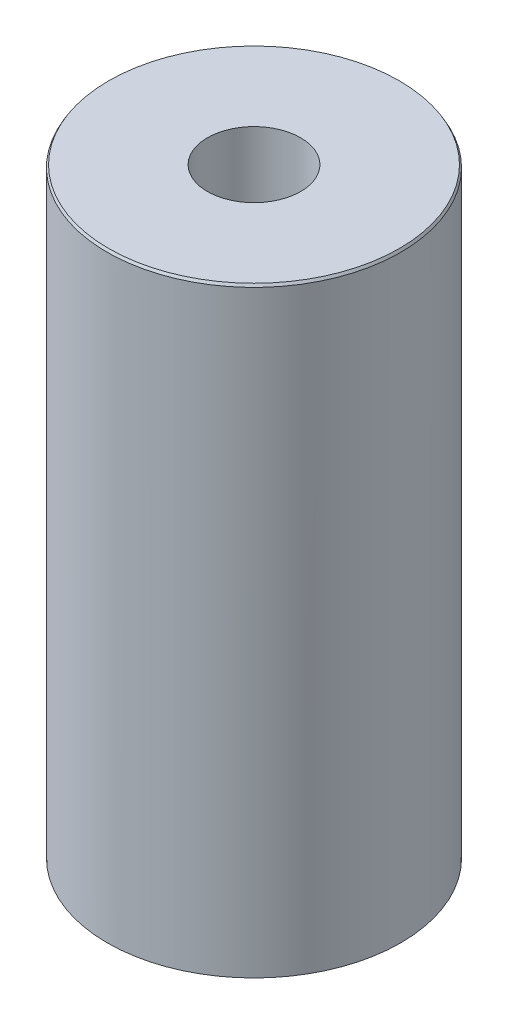
ISO-10303-21;
HEADER;
FILE_DESCRIPTION(('STEP AP214'),'2;1');
FILE_NAME('part.step','',(''),(''),'','','');
FILE_SCHEMA(('AUTOMOTIVE_DESIGN { 1 0 10303 214 1 1 1 1 }'));
ENDSEC;
DATA;
#1=APPLICATION_CONTEXT('core data for automotive mechanical design processes');
#2=APPLICATION_PROTOCOL_DEFINITION('international standard','automotive_design',2000,#1);
#3=PRODUCT_CONTEXT('',#1,'mechanical');
#4=PRODUCT('Part','Part','',(#3));
#5=PRODUCT_RELATED_PRODUCT_CATEGORY('part','',(#4));
#6=PRODUCT_DEFINITION_FORMATION('','',#4);
#7=PRODUCT_DEFINITION_CONTEXT('part definition',#1,'design');
#8=PRODUCT_DEFINITION('design','',#6,#7);
#9=PRODUCT_DEFINITION_SHAPE('','',#8);
#10=(LENGTH_UNIT() NAMED_UNIT(*) SI_UNIT(.MILLI.,.METRE.));
#11=(NAMED_UNIT(*) PLANE_ANGLE_UNIT() SI_UNIT($,.RADIAN.));
#12=(NAMED_UNIT(*) SI_UNIT($,.STERADIAN.) SOLID_ANGLE_UNIT());
#13=UNCERTAINTY_MEASURE_WITH_UNIT(LENGTH_MEASURE(1.E-05),#10,'distance_accuracy_value','');
#14=(GEOMETRIC_REPRESENTATION_CONTEXT(3) GLOBAL_UNCERTAINTY_ASSIGNED_CONTEXT((#13)) GLOBAL_UNIT_ASSIGNED_CONTEXT((#10,
#11,#12)) REPRESENTATION_CONTEXT('',''));
#15=CARTESIAN_POINT('',(0.,0.,0.));
#16=DIRECTION('',(0.,0.,1.));
#17=DIRECTION('',(1.,0.,0.));
#18=AXIS2_PLACEMENT_3D('',#15,#16,#17);
#19=CARTESIAN_POINT('',(0.,235.873118485517,0.));
#20=DIRECTION('',(0.,-1.,0.));
#21=DIRECTION('',(0.,0.,-1.));
#22=AXIS2_PLACEMENT_3D('',#19,#20,#21);
#23=CYLINDRICAL_SURFACE('',#22,57.5);
#24=CARTESIAN_POINT('',(0.,234.875667608635,0.));
#25=DIRECTION('',(0.,1.,0.));
#26=DIRECTION('',(0.,0.,1.));
#27=AXIS2_PLACEMENT_3D('',#24,#25,#26);
#28=CIRCLE('',#27,57.5);
#29=CARTESIAN_POINT('',(0.,234.875667608635,-57.5));
#30=VERTEX_POINT('',#29);
#31=EDGE_CURVE('E50',#30,#30,#28,.F.);
#32=CARTESIAN_POINT('',(0.,0.575878532271534,0.));
#33=DIRECTION('',(0.,1.,0.));
#34=DIRECTION('',(0.,0.,1.));
#35=AXIS2_PLACEMENT_3D('',#32,#33,#34);
#36=CIRCLE('',#35,57.5);
#37=CARTESIAN_POINT('',(0.,0.575878532271534,-57.5));
#38=VERTEX_POINT('',#37);
#39=EDGE_CURVE('E51',#38,#38,#36,.T.);
#40=CARTESIAN_POINT('',(0.,234.875667608635,-57.5));
#41=CARTESIAN_POINT('',(0.,232.435044805756,-57.5));
#42=CARTESIAN_POINT('',(0.,229.994422002877,-57.5));
#43=CARTESIAN_POINT('',(0.,225.113176397119,-57.5));
#44=CARTESIAN_POINT('',(0.,222.672553594241,-57.5));
#45=CARTESIAN_POINT('',(0.,217.791307988483,-57.5));
#46=CARTESIAN_POINT('',(0.,215.350685185604,-57.5));
#47=CARTESIAN_POINT('',(0.,210.469439579847,-57.5));
#48=CARTESIAN_POINT('',(0.,208.028816776968,-57.5));
#49=CARTESIAN_POINT('',(0.,203.14757117121,-57.5));
#50=CARTESIAN_POINT('',(0.,200.706948368332,-57.5));
#51=CARTESIAN_POINT('',(0.,195.825702762574,-57.5));
#52=CARTESIAN_POINT('',(0.,193.385079959695,-57.5));
#53=CARTESIAN_POINT('',(0.,188.503834353938,-57.5));
#54=CARTESIAN_POINT('',(0.,186.063211551059,-57.5));
#55=CARTESIAN_POINT('',(0.,181.181965945301,-57.5));
#56=CARTESIAN_POINT('',(0.,178.741343142423,-57.5));
#57=CARTESIAN_POINT('',(0.,173.860097536665,-57.5));
#58=CARTESIAN_POINT('',(0.,171.419474733786,-57.5));
#59=CARTESIAN_POINT('',(0.,166.538229128029,-57.5));
#60=CARTESIAN_POINT('',(0.,164.09760632515,-57.5));
#61=CARTESIAN_POINT('',(0.,159.216360719392,-57.5));
#62=CARTESIAN_POINT('',(0.,156.775737916514,-57.5));
#63=CARTESIAN_POINT('',(0.,151.894492310756,-57.5));
#64=CARTESIAN_POINT('',(0.,149.453869507877,-57.5));
#65=CARTESIAN_POINT('',(0.,144.57262390212,-57.5));
#66=CARTESIAN_POINT('',(0.,142.132001099241,-57.5));
#67=CARTESIAN_POINT('',(0.,137.250755493483,-57.5));
#68=CARTESIAN_POINT('',(0.,134.810132690605,-57.5));
#69=CARTESIAN_POINT('',(0.,129.928887084847,-57.5));
#70=CARTESIAN_POINT('',(0.,127.488264281968,-57.5));
#71=CARTESIAN_POINT('',(0.,122.607018676211,-57.5));
#72=CARTESIAN_POINT('',(0.,120.166395873332,-57.5));
#73=CARTESIAN_POINT('',(0.,115.285150267574,-57.5));
#74=CARTESIAN_POINT('',(0.,112.844527464695,-57.5));
#75=CARTESIAN_POINT('',(0.,107.963281858938,-57.5));
#76=CARTESIAN_POINT('',(0.,105.522659056059,-57.5));
#77=CARTESIAN_POINT('',(0.,100.641413450302,-57.5));
#78=CARTESIAN_POINT('',(0.,98.2007906474228,-57.5));
#79=CARTESIAN_POINT('',(0.,93.3195450416652,-57.5));
#80=CARTESIAN_POINT('',(0.,90.8789222387864,-57.5));
#81=CARTESIAN_POINT('',(0.,85.9976766330289,-57.5));
#82=CARTESIAN_POINT('',(0.,83.5570538301501,-57.5));
#83=CARTESIAN_POINT('',(0.,78.6758082243925,-57.5));
#84=CARTESIAN_POINT('',(0.,76.2351854215138,-57.5));
#85=CARTESIAN_POINT('',(0.,71.3539398157562,-57.5));
#86=CARTESIAN_POINT('',(0.,68.9133170128774,-57.5));
#87=CARTESIAN_POINT('',(0.,64.0320714071198,-57.5));
#88=CARTESIAN_POINT('',(0.,61.5914486042411,-57.5));
#89=CARTESIAN_POINT('',(0.,56.7102029984835,-57.5));
#90=CARTESIAN_POINT('',(0.,54.2695801956047,-57.5));
#91=CARTESIAN_POINT('',(0.,49.3883345898472,-57.5));
#92=CARTESIAN_POINT('',(0.,46.9477117869684,-57.5));
#93=CARTESIAN_POINT('',(0.,42.0664661812108,-57.5));
#94=CARTESIAN_POINT('',(0.,39.625843378332,-57.5));
#95=CARTESIAN_POINT('',(0.,34.7445977725745,-57.5));
#96=CARTESIAN_POINT('',(0.,32.3039749696957,-57.5));
#97=CARTESIAN_POINT('',(0.,27.4227293639381,-57.5));
#98=CARTESIAN_POINT('',(0.,24.9821065610594,-57.5));
#99=CARTESIAN_POINT('',(0.,20.1008609553018,-57.5));
#100=CARTESIAN_POINT('',(0.,17.660238152423,-57.5));
#101=CARTESIAN_POINT('',(0.,12.7789925466654,-57.5));
#102=CARTESIAN_POINT('',(0.,10.3383697437867,-57.5));
#103=CARTESIAN_POINT('',(0.,5.4571241380291,-57.5));
#104=CARTESIAN_POINT('',(0.,3.01650133515032,-57.5));
#105=CARTESIAN_POINT('',(0.,0.575878532271534,-57.5));
#106=B_SPLINE_CURVE_WITH_KNOTS('',3,(#40,#41,#42,#43,#44,#45,#46,#47,#48,#49,#50,#51,#52,#53,
#54,#55,#56,#57,#58,#59,#60,#61,#62,#63,#64,#65,#66,#67,#68,#69,#70,#71,#72,#73,#74,#75,#76,#77,
#78,#79,#80,#81,#82,#83,#84,#85,#86,#87,#88,#89,#90,#91,#92,#93,#94,#95,#96,#97,#98,#99,#100,
#101,#102,#103,#104,#105),.UNSPECIFIED.,.F.,.F.,(4,2,2,2,2,2,2,2,2,2,2,2,2,2,2,2,2,2,2,2,2,2,2,
2,2,2,2,2,2,2,2,2,4),(0.,7.32186840863633,14.6437368172727,21.965605225909,29.2874736345454,
36.6093420431817,43.9312104518181,51.2530788604544,58.5749472690907,65.8968156777271,
73.2186840863634,80.5405524949997,87.8624209036361,95.1842893122724,102.506157720909,
109.828026129545,117.149894538181,124.471762946818,131.793631355454,139.115499764091,
146.437368172727,153.759236581363,161.08110499,168.402973398636,175.724841807272,
183.046710215909,190.368578624545,197.690447033181,205.012315441818,212.334183850454,
219.65605225909,226.977920667727,234.299789076363),.UNSPECIFIED.);
#107=EDGE_CURVE('BSEAM39',#30,#38,#106,.T.);
#108=ORIENTED_EDGE('',*,*,#31,.T.);
#109=ORIENTED_EDGE('',*,*,#39,.T.);
#110=ORIENTED_EDGE('',*,*,#107,.T.);
#111=ORIENTED_EDGE('',*,*,#107,.F.);
#112=EDGE_LOOP('',(#108,#110,#109,#111));
#113=FACE_BOUND('',#112,.T.);
#114=ADVANCED_FACE('F39',(#113),#23,.T.);
#115=CARTESIAN_POINT('',(0.,235.873118485517,0.));
#116=DIRECTION('',(0.,1.,0.));
#117=DIRECTION('',(0.,0.,1.));
#118=AXIS2_PLACEMENT_3D('',#115,#116,#117);
#119=PLANE('',#118);
#120=CARTESIAN_POINT('',(0.,235.873118485517,0.));
#121=DIRECTION('',(0.,1.,0.));
#122=DIRECTION('',(0.,0.,1.));
#123=AXIS2_PLACEMENT_3D('',#120,#121,#122);
#124=CIRCLE('',#123,56.9241214677287);
#125=CARTESIAN_POINT('',(0.,235.873118485517,56.9241214677287));
#126=VERTEX_POINT('',#125);
#127=EDGE_CURVE('E54',#126,#126,#124,.T.);
#128=ORIENTED_EDGE('',*,*,#127,.T.);
#129=EDGE_LOOP('',(#128));
#130=FACE_BOUND('',#129,.T.);
#131=CARTESIAN_POINT('',(0.,235.873118485517,0.));
#132=DIRECTION('',(0.,1.,0.));
#133=DIRECTION('',(0.,0.,1.));
#134=AXIS2_PLACEMENT_3D('',#131,#132,#133);
#135=CIRCLE('',#134,18.2655293267405);
#136=CARTESIAN_POINT('',(0.,235.873118485517,-18.2655293267405));
#137=VERTEX_POINT('',#136);
#138=EDGE_CURVE('E58',#137,#137,#135,.T.);
#139=ORIENTED_EDGE('',*,*,#138,.F.);
#140=EDGE_LOOP('',(#139));
#141=FACE_BOUND('',#140,.T.);
#142=ADVANCED_FACE('F69',(#130,#141),#119,.T.);
#143=CARTESIAN_POINT('',(0.,0.,0.));
#144=DIRECTION('',(0.,1.,0.));
#145=DIRECTION('',(0.,0.,1.));
#146=AXIS2_PLACEMENT_3D('',#143,#144,#145);
#147=PLANE('',#146);
#148=CARTESIAN_POINT('',(0.,0.,0.));
#149=DIRECTION('',(0.,1.,0.));
#150=DIRECTION('',(0.,0.,1.));
#151=AXIS2_PLACEMENT_3D('',#148,#149,#150);
#152=CIRCLE('',#151,56.5025491231175);
#153=CARTESIAN_POINT('',(0.,0.,56.5025491231175));
#154=VERTEX_POINT('',#153);
#155=EDGE_CURVE('E10',#154,#154,#152,.F.);
#156=ORIENTED_EDGE('',*,*,#155,.T.);
#157=EDGE_LOOP('',(#156));
#158=FACE_BOUND('',#157,.T.);
#159=CARTESIAN_POINT('',(0.,0.,0.));
#160=DIRECTION('',(0.,1.,0.));
#161=DIRECTION('',(0.,0.,1.));
#162=AXIS2_PLACEMENT_3D('',#159,#160,#161);
#163=CIRCLE('',#162,18.2655293267405);
#164=CARTESIAN_POINT('',(0.,0.,-18.2655293267405));
#165=VERTEX_POINT('',#164);
#166=EDGE_CURVE('E63',#165,#165,#163,.T.);
#167=ORIENTED_EDGE('',*,*,#166,.T.);
#168=EDGE_LOOP('',(#167));
#169=FACE_BOUND('',#168,.T.);
#170=ADVANCED_FACE('F75',(#158,#169),#147,.F.);
#171=CARTESIAN_POINT('',(0.,235.873118485517,0.));
#172=DIRECTION('',(0.,-1.,0.));
#173=DIRECTION('',(0.,0.,-1.));
#174=AXIS2_PLACEMENT_3D('',#171,#172,#173);
#175=CYLINDRICAL_SURFACE('',#174,18.2655293267405);
#176=CARTESIAN_POINT('',(0.,235.873118485517,-18.2655293267405));
#177=CARTESIAN_POINT('',(0.,233.416106834626,-18.2655293267405));
#178=CARTESIAN_POINT('',(0.,230.959095183735,-18.2655293267405));
#179=CARTESIAN_POINT('',(0.,226.045071881953,-18.2655293267405));
#180=CARTESIAN_POINT('',(0.,223.588060231063,-18.2655293267405));
#181=CARTESIAN_POINT('',(0.,218.674036929281,-18.2655293267405));
#182=CARTESIAN_POINT('',(0.,216.21702527839,-18.2655293267405));
#183=CARTESIAN_POINT('',(0.,211.303001976609,-18.2655293267405));
#184=CARTESIAN_POINT('',(0.,208.845990325718,-18.2655293267405));
#185=CARTESIAN_POINT('',(0.,203.931967023936,-18.2655293267405));
#186=CARTESIAN_POINT('',(0.,201.474955373045,-18.2655293267405));
#187=CARTESIAN_POINT('',(0.,196.560932071264,-18.2655293267405));
#188=CARTESIAN_POINT('',(0.,194.103920420373,-18.2655293267405));
#189=CARTESIAN_POINT('',(0.,189.189897118591,-18.2655293267405));
#190=CARTESIAN_POINT('',(0.,186.732885467701,-18.2655293267405));
#191=CARTESIAN_POINT('',(0.,181.818862165919,-18.2655293267405));
#192=CARTESIAN_POINT('',(0.,179.361850515028,-18.2655293267405));
#193=CARTESIAN_POINT('',(0.,174.447827213247,-18.2655293267405));
#194=CARTESIAN_POINT('',(0.,171.990815562356,-18.2655293267405));
#195=CARTESIAN_POINT('',(0.,167.076792260574,-18.2655293267405));
#196=CARTESIAN_POINT('',(0.,164.619780609683,-18.2655293267405));
#197=CARTESIAN_POINT('',(0.,159.705757307902,-18.2655293267405));
#198=CARTESIAN_POINT('',(0.,157.248745657011,-18.2655293267405));
#199=CARTESIAN_POINT('',(0.,152.334722355229,-18.2655293267405));
#200=CARTESIAN_POINT('',(0.,149.877710704339,-18.2655293267405));
#201=CARTESIAN_POINT('',(0.,144.963687402557,-18.2655293267405));
#202=CARTESIAN_POINT('',(0.,142.506675751666,-18.2655293267405));
#203=CARTESIAN_POINT('',(0.,137.592652449885,-18.2655293267405));
#204=CARTESIAN_POINT('',(0.,135.135640798994,-18.2655293267405));
#205=CARTESIAN_POINT('',(0.,130.221617497212,-18.2655293267405));
#206=CARTESIAN_POINT('',(0.,127.764605846321,-18.2655293267405));
#207=CARTESIAN_POINT('',(0.,122.85058254454,-18.2655293267405));
#208=CARTESIAN_POINT('',(0.,120.393570893649,-18.2655293267405));
#209=CARTESIAN_POINT('',(0.,115.479547591868,-18.2655293267405));
#210=CARTESIAN_POINT('',(0.,113.022535940977,-18.2655293267405));
#211=CARTESIAN_POINT('',(0.,108.108512639195,-18.2655293267405));
#212=CARTESIAN_POINT('',(0.,105.651500988304,-18.2655293267405));
#213=CARTESIAN_POINT('',(0.,100.737477686523,-18.2655293267405));
#214=CARTESIAN_POINT('',(0.,98.2804660356319,-18.2655293267405));
#215=CARTESIAN_POINT('',(0.,93.3664427338503,-18.2655293267405));
#216=CARTESIAN_POINT('',(0.,90.9094310829595,-18.2655293267405));
#217=CARTESIAN_POINT('',(0.,85.9954077811779,-18.2655293267405));
#218=CARTESIAN_POINT('',(0.,83.5383961302871,-18.2655293267405));
#219=CARTESIAN_POINT('',(0.,78.6243728285055,-18.2655293267405));
#220=CARTESIAN_POINT('',(0.,76.1673611776148,-18.2655293267405));
#221=CARTESIAN_POINT('',(0.,71.2533378758331,-18.2655293267405));
#222=CARTESIAN_POINT('',(0.,68.7963262249423,-18.2655293267405));
#223=CARTESIAN_POINT('',(0.,63.8823029231607,-18.2655293267405));
#224=CARTESIAN_POINT('',(0.,61.42529127227,-18.2655293267405));
#225=CARTESIAN_POINT('',(0.,56.5112679704884,-18.2655293267405));
#226=CARTESIAN_POINT('',(0.,54.0542563195976,-18.2655293267405));
#227=CARTESIAN_POINT('',(0.,49.140233017816,-18.2655293267405));
#228=CARTESIAN_POINT('',(0.,46.6832213669252,-18.2655293267405));
#229=CARTESIAN_POINT('',(0.,41.7691980651436,-18.2655293267405));
#230=CARTESIAN_POINT('',(0.,39.3121864142528,-18.2655293267405));
#231=CARTESIAN_POINT('',(0.,34.3981631124712,-18.2655293267405));
#232=CARTESIAN_POINT('',(0.,31.9411514615804,-18.2655293267405));
#233=CARTESIAN_POINT('',(0.,27.0271281597988,-18.2655293267405));
#234=CARTESIAN_POINT('',(0.,24.570116508908,-18.2655293267405));
#235=CARTESIAN_POINT('',(0.,19.6560932071264,-18.2655293267405));
#236=CARTESIAN_POINT('',(0.,17.1990815562356,-18.2655293267405));
#237=CARTESIAN_POINT('',(0.,12.285058254454,-18.2655293267405));
#238=CARTESIAN_POINT('',(0.,9.82804660356319,-18.2655293267405));
#239=CARTESIAN_POINT('',(0.,4.91402330178159,-18.2655293267405));
#240=CARTESIAN_POINT('',(0.,2.4570116508908,-18.2655293267405));
#241=CARTESIAN_POINT('',(0.,0.,-18.2655293267405));
#242=B_SPLINE_CURVE_WITH_KNOTS('',3,(#176,#177,#178,#179,#180,#181,#182,#183,#184,#185,#186,
#187,#188,#189,#190,#191,#192,#193,#194,#195,#196,#197,#198,#199,#200,#201,#202,#203,#204,#205,
#206,#207,#208,#209,#210,#211,#212,#213,#214,#215,#216,#217,#218,#219,#220,#221,#222,#223,#224,
#225,#226,#227,#228,#229,#230,#231,#232,#233,#234,#235,#236,#237,#238,#239,#240,#241),
.UNSPECIFIED.,.F.,.F.,(4,2,2,2,2,2,2,2,2,2,2,2,2,2,2,2,2,2,2,2,2,2,2,2,2,2,2,2,2,2,2,2,4),(0.,
7.37103495267241,14.7420699053448,22.1131048580172,29.4841398106896,36.855174763362,
44.2262097160344,51.5972446687068,58.9682796213792,66.3393145740515,73.7103495267239,
81.0813844793963,88.4524194320688,95.8234543847411,103.194489337414,110.565524290086,
117.936559242758,125.307594195431,132.678629148103,140.049664100775,147.420699053448,
154.79173400612,162.162768958793,169.533803911465,176.904838864137,184.27587381681,
191.646908769482,199.017943722155,206.388978674827,213.760013627499,221.131048580172,
228.502083532844,235.873118485517),.UNSPECIFIED.);
#243=EDGE_CURVE('BSEAM70',#137,#165,#242,.T.);
#244=ORIENTED_EDGE('',*,*,#138,.T.);
#245=ORIENTED_EDGE('',*,*,#166,.F.);
#246=ORIENTED_EDGE('',*,*,#243,.T.);
#247=ORIENTED_EDGE('',*,*,#243,.F.);
#248=EDGE_LOOP('',(#244,#246,#245,#247));
#249=FACE_BOUND('',#248,.T.);
#250=ADVANCED_FACE('F70',(#249),#175,.F.);
#251=CARTESIAN_POINT('',(0.,235.873118485517,0.));
#252=DIRECTION('',(0.,-1.,0.));
#253=DIRECTION('',(0.,0.,-1.));
#254=AXIS2_PLACEMENT_3D('',#251,#252,#253);
#255=CONICAL_SURFACE('',#254,56.9241214677287,0.523598775598292);
#256=ORIENTED_EDGE('',*,*,#31,.F.);
#257=EDGE_LOOP('',(#256));
#258=FACE_BOUND('',#257,.T.);
#259=ORIENTED_EDGE('',*,*,#127,.F.);
#260=EDGE_LOOP('',(#259));
#261=FACE_BOUND('',#260,.T.);
#262=ADVANCED_FACE('F81',(#258,#261),#255,.T.);
#263=CARTESIAN_POINT('',(0.,0.575878532271534,0.));
#264=DIRECTION('',(0.,1.,0.));
#265=DIRECTION('',(0.,0.,1.));
#266=AXIS2_PLACEMENT_3D('',#263,#264,#265);
#267=CONICAL_SURFACE('',#266,57.5,1.04719755119661);
#268=ORIENTED_EDGE('',*,*,#155,.F.);
#269=EDGE_LOOP('',(#268));
#270=FACE_BOUND('',#269,.T.);
#271=ORIENTED_EDGE('',*,*,#39,.F.);
#272=EDGE_LOOP('',(#271));
#273=FACE_BOUND('',#272,.T.);
#274=ADVANCED_FACE('F45',(#270,#273),#267,.T.);
#275=CLOSED_SHELL('',(#114,#142,#170,#250,#262,#274));
#276=MANIFOLD_SOLID_BREP('B2',#275);
#277=ADVANCED_BREP_SHAPE_REPRESENTATION('',(#18,#276),#14);
#278=SHAPE_DEFINITION_REPRESENTATION(#9,#277);
ENDSEC;
END-ISO-10303-21;
